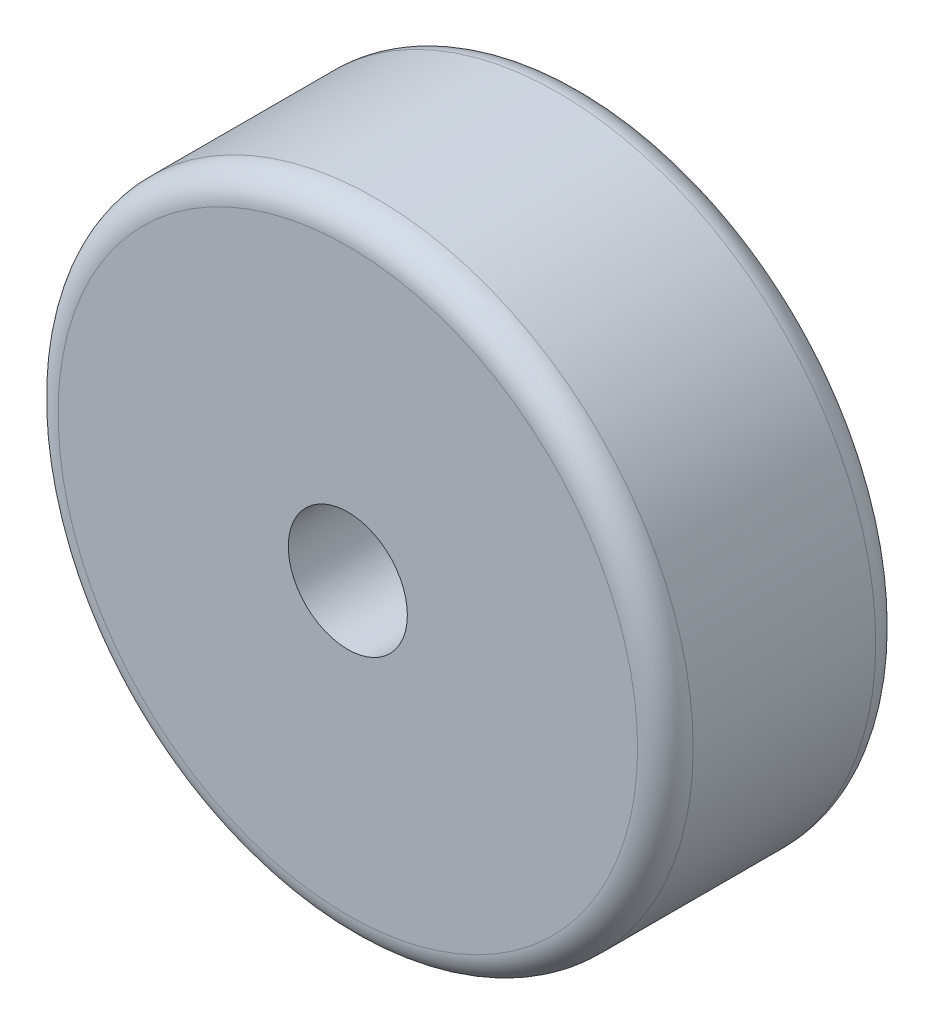
ISO-10303-21;
HEADER;
FILE_DESCRIPTION(('STEP AP214'),'2;1');
FILE_NAME('part.step','',(''),(''),'','','');
FILE_SCHEMA(('AUTOMOTIVE_DESIGN { 1 0 10303 214 1 1 1 1 }'));
ENDSEC;
DATA;
#1=APPLICATION_CONTEXT('core data for automotive mechanical design processes');
#2=APPLICATION_PROTOCOL_DEFINITION('international standard','automotive_design',2000,#1);
#3=PRODUCT_CONTEXT('',#1,'mechanical');
#4=PRODUCT('Part','Part','',(#3));
#5=PRODUCT_RELATED_PRODUCT_CATEGORY('part','',(#4));
#6=PRODUCT_DEFINITION_FORMATION('','',#4);
#7=PRODUCT_DEFINITION_CONTEXT('part definition',#1,'design');
#8=PRODUCT_DEFINITION('design','',#6,#7);
#9=PRODUCT_DEFINITION_SHAPE('','',#8);
#10=(LENGTH_UNIT() NAMED_UNIT(*) SI_UNIT(.MILLI.,.METRE.));
#11=(NAMED_UNIT(*) PLANE_ANGLE_UNIT() SI_UNIT($,.RADIAN.));
#12=(NAMED_UNIT(*) SI_UNIT($,.STERADIAN.) SOLID_ANGLE_UNIT());
#13=UNCERTAINTY_MEASURE_WITH_UNIT(LENGTH_MEASURE(1.E-05),#10,'distance_accuracy_value','');
#14=(GEOMETRIC_REPRESENTATION_CONTEXT(3) GLOBAL_UNCERTAINTY_ASSIGNED_CONTEXT((#13)) GLOBAL_UNIT_ASSIGNED_CONTEXT((#10,
#11,#12)) REPRESENTATION_CONTEXT('',''));
#15=CARTESIAN_POINT('',(0.,0.,0.));
#16=DIRECTION('',(0.,0.,1.));
#17=DIRECTION('',(1.,0.,0.));
#18=AXIS2_PLACEMENT_3D('',#15,#16,#17);
#19=CARTESIAN_POINT('',(0.,0.,38.1));
#20=DIRECTION('',(0.,0.,1.));
#21=DIRECTION('',(1.,0.,0.));
#22=AXIS2_PLACEMENT_3D('',#19,#20,#21);
#23=PLANE('',#22);
#24=CARTESIAN_POINT('',(0.,0.,38.1));
#25=DIRECTION('',(0.,0.,1.));
#26=DIRECTION('',(1.,0.,0.));
#27=AXIS2_PLACEMENT_3D('',#24,#25,#26);
#28=CIRCLE('',#27,92.71);
#29=CARTESIAN_POINT('',(92.71,0.,38.1));
#30=VERTEX_POINT('',#29);
#31=EDGE_CURVE('E10',#30,#30,#28,.T.);
#32=ORIENTED_EDGE('',*,*,#31,.T.);
#33=EDGE_LOOP('',(#32));
#34=FACE_BOUND('',#33,.T.);
#35=CARTESIAN_POINT('',(0.,0.,38.1));
#36=DIRECTION('',(0.,0.,1.));
#37=DIRECTION('',(1.,0.,0.));
#38=AXIS2_PLACEMENT_3D('',#35,#36,#37);
#39=CIRCLE('',#38,19.05);
#40=CARTESIAN_POINT('',(19.05,0.,38.1));
#41=VERTEX_POINT('',#40);
#42=EDGE_CURVE('E61',#41,#41,#39,.T.);
#43=ORIENTED_EDGE('',*,*,#42,.F.);
#44=EDGE_LOOP('',(#43));
#45=FACE_BOUND('',#44,.T.);
#46=ADVANCED_FACE('F37',(#34,#45),#23,.T.);
#47=CARTESIAN_POINT('',(0.,0.,-38.1));
#48=DIRECTION('',(0.,0.,1.));
#49=DIRECTION('',(1.,0.,0.));
#50=AXIS2_PLACEMENT_3D('',#47,#48,#49);
#51=PLANE('',#50);
#52=CARTESIAN_POINT('',(0.,0.,-38.1));
#53=DIRECTION('',(0.,0.,1.));
#54=DIRECTION('',(1.,0.,0.));
#55=AXIS2_PLACEMENT_3D('',#52,#53,#54);
#56=CIRCLE('',#55,92.71);
#57=CARTESIAN_POINT('',(92.71,0.,-38.1));
#58=VERTEX_POINT('',#57);
#59=EDGE_CURVE('E45',#58,#58,#56,.F.);
#60=ORIENTED_EDGE('',*,*,#59,.T.);
#61=EDGE_LOOP('',(#60));
#62=FACE_BOUND('',#61,.T.);
#63=CARTESIAN_POINT('',(0.,0.,-38.1));
#64=DIRECTION('',(0.,0.,1.));
#65=DIRECTION('',(1.,0.,0.));
#66=AXIS2_PLACEMENT_3D('',#63,#64,#65);
#67=CIRCLE('',#66,19.05);
#68=CARTESIAN_POINT('',(19.05,0.,-38.1));
#69=VERTEX_POINT('',#68);
#70=EDGE_CURVE('E62',#69,#69,#67,.T.);
#71=ORIENTED_EDGE('',*,*,#70,.T.);
#72=EDGE_LOOP('',(#71));
#73=FACE_BOUND('',#72,.T.);
#74=ADVANCED_FACE('F74',(#62,#73),#51,.F.);
#75=CARTESIAN_POINT('',(0.,0.,38.1));
#76=DIRECTION('',(0.,0.,-1.));
#77=DIRECTION('',(-1.,0.,0.));
#78=AXIS2_PLACEMENT_3D('',#75,#76,#77);
#79=CYLINDRICAL_SURFACE('',#78,101.6);
#80=CARTESIAN_POINT('',(0.,0.,-29.21));
#81=DIRECTION('',(0.,0.,1.));
#82=DIRECTION('',(1.,0.,0.));
#83=AXIS2_PLACEMENT_3D('',#80,#81,#82);
#84=CIRCLE('',#83,101.6);
#85=CARTESIAN_POINT('',(101.6,0.,-29.21));
#86=VERTEX_POINT('',#85);
#87=EDGE_CURVE('E50',#86,#86,#84,.T.);
#88=ORIENTED_EDGE('',*,*,#87,.T.);
#89=EDGE_LOOP('',(#88));
#90=FACE_BOUND('',#89,.T.);
#91=CARTESIAN_POINT('',(0.,0.,29.21));
#92=DIRECTION('',(0.,0.,1.));
#93=DIRECTION('',(1.,0.,0.));
#94=AXIS2_PLACEMENT_3D('',#91,#92,#93);
#95=CIRCLE('',#94,101.6);
#96=CARTESIAN_POINT('',(101.6,0.,29.21));
#97=VERTEX_POINT('',#96);
#98=EDGE_CURVE('E55',#97,#97,#95,.F.);
#99=ORIENTED_EDGE('',*,*,#98,.T.);
#100=EDGE_LOOP('',(#99));
#101=FACE_BOUND('',#100,.T.);
#102=ADVANCED_FACE('F79',(#90,#101),#79,.T.);
#103=CARTESIAN_POINT('',(0.,0.,38.1));
#104=DIRECTION('',(0.,0.,-1.));
#105=DIRECTION('',(-1.,0.,0.));
#106=AXIS2_PLACEMENT_3D('',#103,#104,#105);
#107=CYLINDRICAL_SURFACE('',#106,19.05);
#108=ORIENTED_EDGE('',*,*,#42,.T.);
#109=EDGE_LOOP('',(#108));
#110=FACE_BOUND('',#109,.T.);
#111=ORIENTED_EDGE('',*,*,#70,.F.);
#112=EDGE_LOOP('',(#111));
#113=FACE_BOUND('',#112,.T.);
#114=ADVANCED_FACE('F70',(#110,#113),#107,.F.);
#115=CARTESIAN_POINT('',(0.,0.,-29.21));
#116=DIRECTION('',(0.,0.,1.));
#117=DIRECTION('',(1.,0.,0.));
#118=AXIS2_PLACEMENT_3D('',#115,#116,#117);
#119=TOROIDAL_SURFACE('',#118,92.71,8.89);
#120=ORIENTED_EDGE('',*,*,#59,.F.);
#121=EDGE_LOOP('',(#120));
#122=FACE_BOUND('',#121,.T.);
#123=ORIENTED_EDGE('',*,*,#87,.F.);
#124=EDGE_LOOP('',(#123));
#125=FACE_BOUND('',#124,.T.);
#126=ADVANCED_FACE('F85',(#122,#125),#119,.T.);
#127=CARTESIAN_POINT('',(0.,0.,29.21));
#128=DIRECTION('',(0.,0.,1.));
#129=DIRECTION('',(1.,0.,0.));
#130=AXIS2_PLACEMENT_3D('',#127,#128,#129);
#131=TOROIDAL_SURFACE('',#130,92.71,8.89);
#132=ORIENTED_EDGE('',*,*,#98,.F.);
#133=EDGE_LOOP('',(#132));
#134=FACE_BOUND('',#133,.T.);
#135=ORIENTED_EDGE('',*,*,#31,.F.);
#136=EDGE_LOOP('',(#135));
#137=FACE_BOUND('',#136,.T.);
#138=ADVANCED_FACE('F39',(#134,#137),#131,.T.);
#139=CLOSED_SHELL('',(#46,#74,#102,#114,#126,#138));
#140=MANIFOLD_SOLID_BREP('B2',#139);
#141=ADVANCED_BREP_SHAPE_REPRESENTATION('',(#18,#140),#14);
#142=SHAPE_DEFINITION_REPRESENTATION(#9,#141);
ENDSEC;
END-ISO-10303-21;
